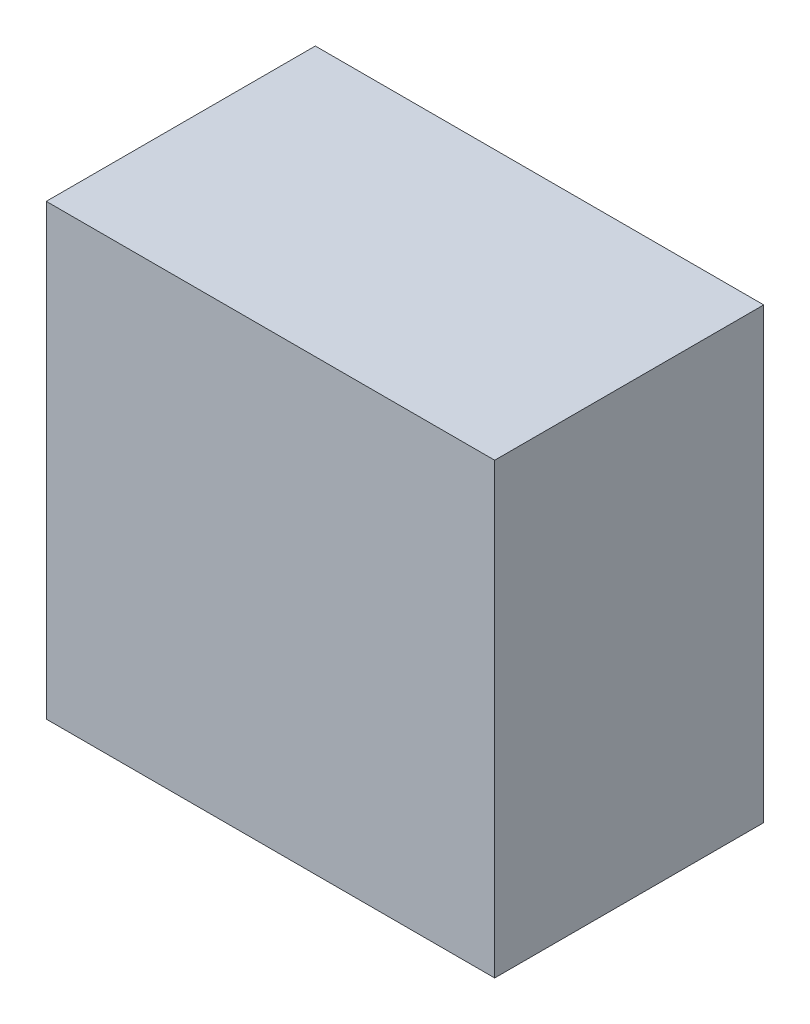
ISO-10303-21;
HEADER;
FILE_DESCRIPTION(('STEP AP214'),'2;1');
FILE_NAME('part.step','',(''),(''),'','','');
FILE_SCHEMA(('AUTOMOTIVE_DESIGN { 1 0 10303 214 1 1 1 1 }'));
ENDSEC;
DATA;
#1=APPLICATION_CONTEXT('core data for automotive mechanical design processes');
#2=APPLICATION_PROTOCOL_DEFINITION('international standard','automotive_design',2000,#1);
#3=PRODUCT_CONTEXT('',#1,'mechanical');
#4=PRODUCT('Part','Part','',(#3));
#5=PRODUCT_RELATED_PRODUCT_CATEGORY('part','',(#4));
#6=PRODUCT_DEFINITION_FORMATION('','',#4);
#7=PRODUCT_DEFINITION_CONTEXT('part definition',#1,'design');
#8=PRODUCT_DEFINITION('design','',#6,#7);
#9=PRODUCT_DEFINITION_SHAPE('','',#8);
#10=(LENGTH_UNIT() NAMED_UNIT(*) SI_UNIT(.MILLI.,.METRE.));
#11=(NAMED_UNIT(*) PLANE_ANGLE_UNIT() SI_UNIT($,.RADIAN.));
#12=(NAMED_UNIT(*) SI_UNIT($,.STERADIAN.) SOLID_ANGLE_UNIT());
#13=UNCERTAINTY_MEASURE_WITH_UNIT(LENGTH_MEASURE(1.E-05),#10,'distance_accuracy_value','');
#14=(GEOMETRIC_REPRESENTATION_CONTEXT(3) GLOBAL_UNCERTAINTY_ASSIGNED_CONTEXT((#13)) GLOBAL_UNIT_ASSIGNED_CONTEXT((#10,
#11,#12)) REPRESENTATION_CONTEXT('',''));
#15=CARTESIAN_POINT('',(0.,0.,0.));
#16=DIRECTION('',(0.,0.,1.));
#17=DIRECTION('',(1.,0.,0.));
#18=AXIS2_PLACEMENT_3D('',#15,#16,#17);
#19=CARTESIAN_POINT('',(0.,0.,0.17999964));
#20=DIRECTION('',(0.,0.,1.));
#21=DIRECTION('',(1.,0.,0.));
#22=AXIS2_PLACEMENT_3D('',#19,#20,#21);
#23=PLANE('',#22);
#24=DIRECTION('',(-1.,0.,0.));
#25=VECTOR('',#24,1.);
#26=CARTESIAN_POINT('',(0.1499997,0.1499997,0.17999964));
#27=LINE('',#26,#25);
#28=CARTESIAN_POINT('',(0.1499997,0.1499997,0.17999964));
#29=VERTEX_POINT('',#28);
#30=CARTESIAN_POINT('',(-0.1499997,0.1499997,0.17999964));
#31=VERTEX_POINT('',#30);
#32=EDGE_CURVE('E67',#29,#31,#27,.T.);
#33=ORIENTED_EDGE('',*,*,#32,.T.);
#34=DIRECTION('',(0.,-1.,0.));
#35=VECTOR('',#34,1.);
#36=CARTESIAN_POINT('',(-0.1499997,0.1499997,0.17999964));
#37=LINE('',#36,#35);
#38=CARTESIAN_POINT('',(-0.1499997,-0.1499997,0.17999964));
#39=VERTEX_POINT('',#38);
#40=EDGE_CURVE('E93',#31,#39,#37,.T.);
#41=ORIENTED_EDGE('',*,*,#40,.T.);
#42=DIRECTION('',(1.,0.,0.));
#43=VECTOR('',#42,1.);
#44=CARTESIAN_POINT('',(-0.1499997,-0.1499997,0.17999964));
#45=LINE('',#44,#43);
#46=CARTESIAN_POINT('',(0.1499997,-0.1499997,0.17999964));
#47=VERTEX_POINT('',#46);
#48=EDGE_CURVE('E69',#39,#47,#45,.T.);
#49=ORIENTED_EDGE('',*,*,#48,.T.);
#50=DIRECTION('',(0.,1.,0.));
#51=VECTOR('',#50,1.);
#52=CARTESIAN_POINT('',(0.1499997,-0.1499997,0.17999964));
#53=LINE('',#52,#51);
#54=EDGE_CURVE('E11',#47,#29,#53,.T.);
#55=ORIENTED_EDGE('',*,*,#54,.T.);
#56=EDGE_LOOP('',(#33,#41,#49,#55));
#57=FACE_BOUND('',#56,.T.);
#58=ADVANCED_FACE('F16',(#57),#23,.T.);
#59=CARTESIAN_POINT('',(0.,0.,0.));
#60=DIRECTION('',(0.,0.,1.));
#61=DIRECTION('',(1.,0.,0.));
#62=AXIS2_PLACEMENT_3D('',#59,#60,#61);
#63=PLANE('',#62);
#64=DIRECTION('',(-1.,0.,0.));
#65=VECTOR('',#64,1.);
#66=CARTESIAN_POINT('',(0.1499997,0.1499997,0.));
#67=LINE('',#66,#65);
#68=CARTESIAN_POINT('',(0.1499997,0.1499997,0.));
#69=VERTEX_POINT('',#68);
#70=CARTESIAN_POINT('',(-0.1499997,0.1499997,0.));
#71=VERTEX_POINT('',#70);
#72=EDGE_CURVE('E84',#69,#71,#67,.T.);
#73=ORIENTED_EDGE('',*,*,#72,.F.);
#74=DIRECTION('',(0.,1.,0.));
#75=VECTOR('',#74,1.);
#76=CARTESIAN_POINT('',(0.1499997,-0.1499997,0.));
#77=LINE('',#76,#75);
#78=CARTESIAN_POINT('',(0.1499997,-0.1499997,0.));
#79=VERTEX_POINT('',#78);
#80=EDGE_CURVE('E27',#79,#69,#77,.T.);
#81=ORIENTED_EDGE('',*,*,#80,.F.);
#82=DIRECTION('',(1.,0.,0.));
#83=VECTOR('',#82,1.);
#84=CARTESIAN_POINT('',(-0.1499997,-0.1499997,0.));
#85=LINE('',#84,#83);
#86=CARTESIAN_POINT('',(-0.1499997,-0.1499997,0.));
#87=VERTEX_POINT('',#86);
#88=EDGE_CURVE('E20',#87,#79,#85,.T.);
#89=ORIENTED_EDGE('',*,*,#88,.F.);
#90=DIRECTION('',(0.,-1.,0.));
#91=VECTOR('',#90,1.);
#92=CARTESIAN_POINT('',(-0.1499997,0.1499997,0.));
#93=LINE('',#92,#91);
#94=EDGE_CURVE('E79',#71,#87,#93,.T.);
#95=ORIENTED_EDGE('',*,*,#94,.F.);
#96=EDGE_LOOP('',(#73,#81,#89,#95));
#97=FACE_BOUND('',#96,.T.);
#98=ADVANCED_FACE('F150',(#97),#63,.F.);
#99=CARTESIAN_POINT('',(0.1499997,-0.1499997,0.));
#100=DIRECTION('',(-1.,0.,0.));
#101=DIRECTION('',(0.,0.,1.));
#102=AXIS2_PLACEMENT_3D('',#99,#100,#101);
#103=PLANE('',#102);
#104=DIRECTION('',(0.,0.,1.));
#105=VECTOR('',#104,1.);
#106=CARTESIAN_POINT('',(0.1499997,-0.1499997,0.));
#107=LINE('',#106,#105);
#108=EDGE_CURVE('E95',#79,#47,#107,.T.);
#109=ORIENTED_EDGE('',*,*,#108,.F.);
#110=ORIENTED_EDGE('',*,*,#80,.T.);
#111=DIRECTION('',(0.,0.,1.));
#112=VECTOR('',#111,1.);
#113=CARTESIAN_POINT('',(0.1499997,0.1499997,0.));
#114=LINE('',#113,#112);
#115=EDGE_CURVE('E75',#69,#29,#114,.T.);
#116=ORIENTED_EDGE('',*,*,#115,.T.);
#117=ORIENTED_EDGE('',*,*,#54,.F.);
#118=EDGE_LOOP('',(#109,#110,#116,#117));
#119=FACE_BOUND('',#118,.T.);
#120=ADVANCED_FACE('F81',(#119),#103,.F.);
#121=CARTESIAN_POINT('',(-0.1499997,-0.1499997,0.));
#122=DIRECTION('',(0.,1.,0.));
#123=DIRECTION('',(1.,0.,0.));
#124=AXIS2_PLACEMENT_3D('',#121,#122,#123);
#125=PLANE('',#124);
#126=DIRECTION('',(0.,0.,1.));
#127=VECTOR('',#126,1.);
#128=CARTESIAN_POINT('',(-0.1499997,-0.1499997,0.));
#129=LINE('',#128,#127);
#130=EDGE_CURVE('E98',#87,#39,#129,.T.);
#131=ORIENTED_EDGE('',*,*,#130,.F.);
#132=ORIENTED_EDGE('',*,*,#88,.T.);
#133=ORIENTED_EDGE('',*,*,#108,.T.);
#134=ORIENTED_EDGE('',*,*,#48,.F.);
#135=EDGE_LOOP('',(#131,#132,#133,#134));
#136=FACE_BOUND('',#135,.T.);
#137=ADVANCED_FACE('F164',(#136),#125,.F.);
#138=CARTESIAN_POINT('',(-0.1499997,0.1499997,0.));
#139=DIRECTION('',(1.,0.,0.));
#140=DIRECTION('',(0.,1.,0.));
#141=AXIS2_PLACEMENT_3D('',#138,#139,#140);
#142=PLANE('',#141);
#143=DIRECTION('',(0.,0.,1.));
#144=VECTOR('',#143,1.);
#145=CARTESIAN_POINT('',(-0.1499997,0.1499997,0.));
#146=LINE('',#145,#144);
#147=EDGE_CURVE('E77',#71,#31,#146,.T.);
#148=ORIENTED_EDGE('',*,*,#147,.F.);
#149=ORIENTED_EDGE('',*,*,#94,.T.);
#150=ORIENTED_EDGE('',*,*,#130,.T.);
#151=ORIENTED_EDGE('',*,*,#40,.F.);
#152=EDGE_LOOP('',(#148,#149,#150,#151));
#153=FACE_BOUND('',#152,.T.);
#154=ADVANCED_FACE('F18',(#153),#142,.F.);
#155=CARTESIAN_POINT('',(0.1499997,0.1499997,0.));
#156=DIRECTION('',(0.,-1.,0.));
#157=DIRECTION('',(0.,0.,-1.));
#158=AXIS2_PLACEMENT_3D('',#155,#156,#157);
#159=PLANE('',#158);
#160=ORIENTED_EDGE('',*,*,#115,.F.);
#161=ORIENTED_EDGE('',*,*,#72,.T.);
#162=ORIENTED_EDGE('',*,*,#147,.T.);
#163=ORIENTED_EDGE('',*,*,#32,.F.);
#164=EDGE_LOOP('',(#160,#161,#162,#163));
#165=FACE_BOUND('',#164,.T.);
#166=ADVANCED_FACE('F73',(#165),#159,.F.);
#167=CLOSED_SHELL('',(#58,#98,#120,#137,#154,#166));
#168=MANIFOLD_SOLID_BREP('B1',#167);
#169=ADVANCED_BREP_SHAPE_REPRESENTATION('',(#18,#168),#14);
#170=SHAPE_DEFINITION_REPRESENTATION(#9,#169);
ENDSEC;
END-ISO-10303-21;
